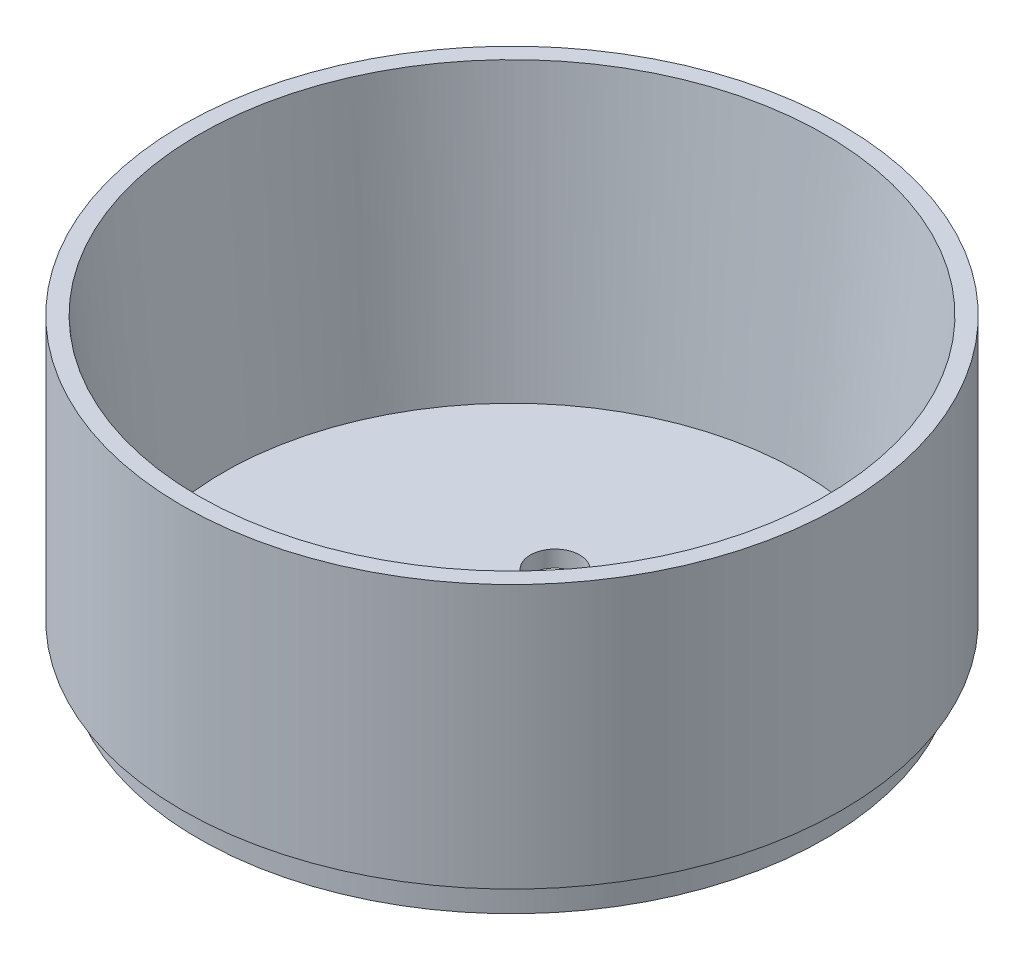
ISO-10303-21;
HEADER;
FILE_DESCRIPTION(('STEP AP214'),'2;1');
FILE_NAME('part.step','',(''),(''),'','','');
FILE_SCHEMA(('AUTOMOTIVE_DESIGN { 1 0 10303 214 1 1 1 1 }'));
ENDSEC;
DATA;
#1=APPLICATION_CONTEXT('core data for automotive mechanical design processes');
#2=APPLICATION_PROTOCOL_DEFINITION('international standard','automotive_design',2000,#1);
#3=PRODUCT_CONTEXT('',#1,'mechanical');
#4=PRODUCT('Part','Part','',(#3));
#5=PRODUCT_RELATED_PRODUCT_CATEGORY('part','',(#4));
#6=PRODUCT_DEFINITION_FORMATION('','',#4);
#7=PRODUCT_DEFINITION_CONTEXT('part definition',#1,'design');
#8=PRODUCT_DEFINITION('design','',#6,#7);
#9=PRODUCT_DEFINITION_SHAPE('','',#8);
#10=(LENGTH_UNIT() NAMED_UNIT(*) SI_UNIT(.MILLI.,.METRE.));
#11=(NAMED_UNIT(*) PLANE_ANGLE_UNIT() SI_UNIT($,.RADIAN.));
#12=(NAMED_UNIT(*) SI_UNIT($,.STERADIAN.) SOLID_ANGLE_UNIT());
#13=UNCERTAINTY_MEASURE_WITH_UNIT(LENGTH_MEASURE(1.E-05),#10,'distance_accuracy_value','');
#14=(GEOMETRIC_REPRESENTATION_CONTEXT(3) GLOBAL_UNCERTAINTY_ASSIGNED_CONTEXT((#13)) GLOBAL_UNIT_ASSIGNED_CONTEXT((#10,
#11,#12)) REPRESENTATION_CONTEXT('',''));
#15=CARTESIAN_POINT('',(0.,0.,0.));
#16=DIRECTION('',(0.,0.,1.));
#17=DIRECTION('',(1.,0.,0.));
#18=AXIS2_PLACEMENT_3D('',#15,#16,#17);
#19=CARTESIAN_POINT('',(0.,50.8,0.));
#20=DIRECTION('',(0.,-1.,0.));
#21=DIRECTION('',(0.,0.,-1.));
#22=AXIS2_PLACEMENT_3D('',#19,#20,#21);
#23=CYLINDRICAL_SURFACE('',#22,63.5);
#24=CARTESIAN_POINT('',(0.,50.8,0.));
#25=DIRECTION('',(0.,1.,0.));
#26=DIRECTION('',(0.,0.,1.));
#27=AXIS2_PLACEMENT_3D('',#24,#25,#26);
#28=CIRCLE('',#27,63.5);
#29=CARTESIAN_POINT('',(0.,50.8,63.5));
#30=VERTEX_POINT('',#29);
#31=EDGE_CURVE('E42',#30,#30,#28,.T.);
#32=ORIENTED_EDGE('',*,*,#31,.F.);
#33=EDGE_LOOP('',(#32));
#34=FACE_BOUND('',#33,.T.);
#35=CARTESIAN_POINT('',(0.,0.,0.));
#36=DIRECTION('',(0.,1.,0.));
#37=DIRECTION('',(0.,0.,1.));
#38=AXIS2_PLACEMENT_3D('',#35,#36,#37);
#39=CIRCLE('',#38,63.5);
#40=CARTESIAN_POINT('',(0.,0.,63.5));
#41=VERTEX_POINT('',#40);
#42=EDGE_CURVE('E38',#41,#41,#39,.T.);
#43=ORIENTED_EDGE('',*,*,#42,.T.);
#44=EDGE_LOOP('',(#43));
#45=FACE_BOUND('',#44,.T.);
#46=ADVANCED_FACE('F35',(#34,#45),#23,.T.);
#47=CARTESIAN_POINT('',(0.,50.8,0.));
#48=DIRECTION('',(0.,1.,0.));
#49=DIRECTION('',(0.,0.,1.));
#50=AXIS2_PLACEMENT_3D('',#47,#48,#49);
#51=PLANE('',#50);
#52=CARTESIAN_POINT('',(0.,50.8,0.));
#53=DIRECTION('',(0.,1.,0.));
#54=DIRECTION('',(0.,0.,1.));
#55=AXIS2_PLACEMENT_3D('',#52,#53,#54);
#56=CIRCLE('',#55,60.325);
#57=CARTESIAN_POINT('',(0.,50.8,60.325));
#58=VERTEX_POINT('',#57);
#59=EDGE_CURVE('E54',#58,#58,#56,.T.);
#60=ORIENTED_EDGE('',*,*,#59,.F.);
#61=EDGE_LOOP('',(#60));
#62=FACE_BOUND('',#61,.T.);
#63=ORIENTED_EDGE('',*,*,#31,.T.);
#64=EDGE_LOOP('',(#63));
#65=FACE_BOUND('',#64,.T.);
#66=ADVANCED_FACE('F102',(#62,#65),#51,.T.);
#67=CARTESIAN_POINT('',(0.,0.,0.));
#68=DIRECTION('',(0.,1.,0.));
#69=DIRECTION('',(0.,0.,1.));
#70=AXIS2_PLACEMENT_3D('',#67,#68,#69);
#71=PLANE('',#70);
#72=CARTESIAN_POINT('',(0.,0.,0.));
#73=DIRECTION('',(0.,-1.,0.));
#74=DIRECTION('',(0.,0.,-1.));
#75=AXIS2_PLACEMENT_3D('',#72,#73,#74);
#76=CIRCLE('',#75,60.325);
#77=CARTESIAN_POINT('',(0.,0.,-60.325));
#78=VERTEX_POINT('',#77);
#79=EDGE_CURVE('E11',#78,#78,#76,.T.);
#80=ORIENTED_EDGE('',*,*,#79,.F.);
#81=EDGE_LOOP('',(#80));
#82=FACE_BOUND('',#81,.T.);
#83=ORIENTED_EDGE('',*,*,#42,.F.);
#84=EDGE_LOOP('',(#83));
#85=FACE_BOUND('',#84,.T.);
#86=ADVANCED_FACE('F107',(#82,#85),#71,.F.);
#87=CARTESIAN_POINT('',(0.,-6.35,0.));
#88=DIRECTION('',(0.,1.,0.));
#89=DIRECTION('',(0.,0.,1.));
#90=AXIS2_PLACEMENT_3D('',#87,#88,#89);
#91=CYLINDRICAL_SURFACE('',#90,60.325);
#92=CARTESIAN_POINT('',(0.,-6.35,0.));
#93=DIRECTION('',(0.,-1.,0.));
#94=DIRECTION('',(0.,0.,-1.));
#95=AXIS2_PLACEMENT_3D('',#92,#93,#94);
#96=CIRCLE('',#95,60.325);
#97=CARTESIAN_POINT('',(0.,-6.35,-60.325));
#98=VERTEX_POINT('',#97);
#99=EDGE_CURVE('E48',#98,#98,#96,.T.);
#100=ORIENTED_EDGE('',*,*,#99,.F.);
#101=EDGE_LOOP('',(#100));
#102=FACE_BOUND('',#101,.T.);
#103=ORIENTED_EDGE('',*,*,#79,.T.);
#104=EDGE_LOOP('',(#103));
#105=FACE_BOUND('',#104,.T.);
#106=ADVANCED_FACE('F116',(#102,#105),#91,.T.);
#107=CARTESIAN_POINT('',(0.,-6.35,0.));
#108=DIRECTION('',(0.,-1.,0.));
#109=DIRECTION('',(0.,0.,-1.));
#110=AXIS2_PLACEMENT_3D('',#107,#108,#109);
#111=PLANE('',#110);
#112=CARTESIAN_POINT('',(7.48713179512813,-6.35,15.7759869337034));
#113=DIRECTION('',(0.,-1.,0.));
#114=DIRECTION('',(0.,0.,-1.));
#115=AXIS2_PLACEMENT_3D('',#112,#113,#114);
#116=CIRCLE('',#115,4.7625);
#117=CARTESIAN_POINT('',(7.48713179512813,-6.35,11.0134869337034));
#118=VERTEX_POINT('',#117);
#119=EDGE_CURVE('E57',#118,#118,#116,.F.);
#120=ORIENTED_EDGE('',*,*,#119,.T.);
#121=EDGE_LOOP('',(#120));
#122=FACE_BOUND('',#121,.T.);
#123=CARTESIAN_POINT('',(1.2743573258838E-13,-6.35,0.));
#124=DIRECTION('',(0.,-1.,0.));
#125=DIRECTION('',(0.,0.,-1.));
#126=AXIS2_PLACEMENT_3D('',#123,#124,#125);
#127=CIRCLE('',#126,4.7625);
#128=CARTESIAN_POINT('',(1.2743573258838E-13,-6.35,-4.76250000000004));
#129=VERTEX_POINT('',#128);
#130=EDGE_CURVE('E65',#129,#129,#127,.F.);
#131=ORIENTED_EDGE('',*,*,#130,.T.);
#132=EDGE_LOOP('',(#131));
#133=FACE_BOUND('',#132,.T.);
#134=CARTESIAN_POINT('',(-7.48713179512813,-6.35,-15.7759869337034));
#135=DIRECTION('',(0.,-1.,0.));
#136=DIRECTION('',(0.,0.,-1.));
#137=AXIS2_PLACEMENT_3D('',#134,#135,#136);
#138=CIRCLE('',#137,4.7625);
#139=CARTESIAN_POINT('',(-7.48713179512813,-6.35,-20.5384869337034));
#140=VERTEX_POINT('',#139);
#141=EDGE_CURVE('E58',#140,#140,#138,.F.);
#142=ORIENTED_EDGE('',*,*,#141,.T.);
#143=EDGE_LOOP('',(#142));
#144=FACE_BOUND('',#143,.T.);
#145=ORIENTED_EDGE('',*,*,#99,.T.);
#146=EDGE_LOOP('',(#145));
#147=FACE_BOUND('',#146,.T.);
#148=ADVANCED_FACE('F83',(#122,#133,#144,#147),#111,.T.);
#149=CARTESIAN_POINT('',(0.,-3.175,0.));
#150=DIRECTION('',(0.,-1.,0.));
#151=DIRECTION('',(0.,0.,-1.));
#152=AXIS2_PLACEMENT_3D('',#149,#150,#151);
#153=PLANE('',#152);
#154=CARTESIAN_POINT('',(7.48713179512813,-3.175,15.7759869337034));
#155=DIRECTION('',(0.,1.,0.));
#156=DIRECTION('',(0.,0.,1.));
#157=AXIS2_PLACEMENT_3D('',#154,#155,#156);
#158=CIRCLE('',#157,4.7625);
#159=CARTESIAN_POINT('',(7.48713179512813,-3.175,20.5384869337034));
#160=VERTEX_POINT('',#159);
#161=EDGE_CURVE('E68',#160,#160,#158,.T.);
#162=ORIENTED_EDGE('',*,*,#161,.F.);
#163=EDGE_LOOP('',(#162));
#164=FACE_BOUND('',#163,.T.);
#165=CARTESIAN_POINT('',(1.2743573258838E-13,-3.175,0.));
#166=DIRECTION('',(0.,1.,0.));
#167=DIRECTION('',(0.,0.,1.));
#168=AXIS2_PLACEMENT_3D('',#165,#166,#167);
#169=CIRCLE('',#168,4.7625);
#170=CARTESIAN_POINT('',(1.2743573258838E-13,-3.175,4.76249999999996));
#171=VERTEX_POINT('',#170);
#172=EDGE_CURVE('E61',#171,#171,#169,.T.);
#173=ORIENTED_EDGE('',*,*,#172,.F.);
#174=EDGE_LOOP('',(#173));
#175=FACE_BOUND('',#174,.T.);
#176=CARTESIAN_POINT('',(-7.48713179512813,-3.175,-15.7759869337034));
#177=DIRECTION('',(0.,1.,0.));
#178=DIRECTION('',(0.,0.,1.));
#179=AXIS2_PLACEMENT_3D('',#176,#177,#178);
#180=CIRCLE('',#179,4.7625);
#181=CARTESIAN_POINT('',(-7.48713179512813,-3.175,-11.0134869337034));
#182=VERTEX_POINT('',#181);
#183=EDGE_CURVE('E62',#182,#182,#180,.T.);
#184=ORIENTED_EDGE('',*,*,#183,.F.);
#185=EDGE_LOOP('',(#184));
#186=FACE_BOUND('',#185,.T.);
#187=CARTESIAN_POINT('',(0.,-3.175,0.));
#188=DIRECTION('',(0.,-1.,0.));
#189=DIRECTION('',(0.,0.,-1.));
#190=AXIS2_PLACEMENT_3D('',#187,#188,#189);
#191=CIRCLE('',#190,55.6027993861883);
#192=CARTESIAN_POINT('',(0.,-3.175,-55.6027993861883));
#193=VERTEX_POINT('',#192);
#194=EDGE_CURVE('E51',#193,#193,#191,.F.);
#195=ORIENTED_EDGE('',*,*,#194,.T.);
#196=EDGE_LOOP('',(#195));
#197=FACE_BOUND('',#196,.T.);
#198=ADVANCED_FACE('F79',(#164,#175,#186,#197),#153,.F.);
#199=CARTESIAN_POINT('',(0.,50.8,0.));
#200=DIRECTION('',(0.,1.,0.));
#201=DIRECTION('',(0.,0.,1.));
#202=AXIS2_PLACEMENT_3D('',#199,#200,#201);
#203=CONICAL_SURFACE('',#202,60.325,0.0872664625997165);
#204=ORIENTED_EDGE('',*,*,#59,.T.);
#205=EDGE_LOOP('',(#204));
#206=FACE_BOUND('',#205,.T.);
#207=ORIENTED_EDGE('',*,*,#194,.F.);
#208=EDGE_LOOP('',(#207));
#209=FACE_BOUND('',#208,.T.);
#210=ADVANCED_FACE('F82',(#206,#209),#203,.F.);
#211=CARTESIAN_POINT('',(-7.48713179512813,-19.8203841816037,-15.7759869337034));
#212=DIRECTION('',(0.,1.,0.));
#213=DIRECTION('',(0.,0.,1.));
#214=AXIS2_PLACEMENT_3D('',#211,#212,#213);
#215=CYLINDRICAL_SURFACE('',#214,4.7625);
#216=ORIENTED_EDGE('',*,*,#183,.T.);
#217=EDGE_LOOP('',(#216));
#218=FACE_BOUND('',#217,.T.);
#219=ORIENTED_EDGE('',*,*,#141,.F.);
#220=EDGE_LOOP('',(#219));
#221=FACE_BOUND('',#220,.T.);
#222=ADVANCED_FACE('F92',(#218,#221),#215,.F.);
#223=CARTESIAN_POINT('',(1.2743573258838E-13,-19.8203841816037,0.));
#224=DIRECTION('',(0.,1.,0.));
#225=DIRECTION('',(0.,0.,1.));
#226=AXIS2_PLACEMENT_3D('',#223,#224,#225);
#227=CYLINDRICAL_SURFACE('',#226,4.7625);
#228=ORIENTED_EDGE('',*,*,#172,.T.);
#229=EDGE_LOOP('',(#228));
#230=FACE_BOUND('',#229,.T.);
#231=ORIENTED_EDGE('',*,*,#130,.F.);
#232=EDGE_LOOP('',(#231));
#233=FACE_BOUND('',#232,.T.);
#234=ADVANCED_FACE('F98',(#230,#233),#227,.F.);
#235=CARTESIAN_POINT('',(7.48713179512813,-19.8203841816037,15.7759869337034));
#236=DIRECTION('',(0.,1.,0.));
#237=DIRECTION('',(0.,0.,1.));
#238=AXIS2_PLACEMENT_3D('',#235,#236,#237);
#239=CYLINDRICAL_SURFACE('',#238,4.7625);
#240=ORIENTED_EDGE('',*,*,#161,.T.);
#241=EDGE_LOOP('',(#240));
#242=FACE_BOUND('',#241,.T.);
#243=ORIENTED_EDGE('',*,*,#119,.F.);
#244=EDGE_LOOP('',(#243));
#245=FACE_BOUND('',#244,.T.);
#246=ADVANCED_FACE('F76',(#242,#245),#239,.F.);
#247=CLOSED_SHELL('',(#46,#66,#86,#106,#148,#198,#210,#222,#234,#246));
#248=MANIFOLD_SOLID_BREP('B2',#247);
#249=ADVANCED_BREP_SHAPE_REPRESENTATION('',(#18,#248),#14);
#250=SHAPE_DEFINITION_REPRESENTATION(#9,#249);
ENDSEC;
END-ISO-10303-21;
